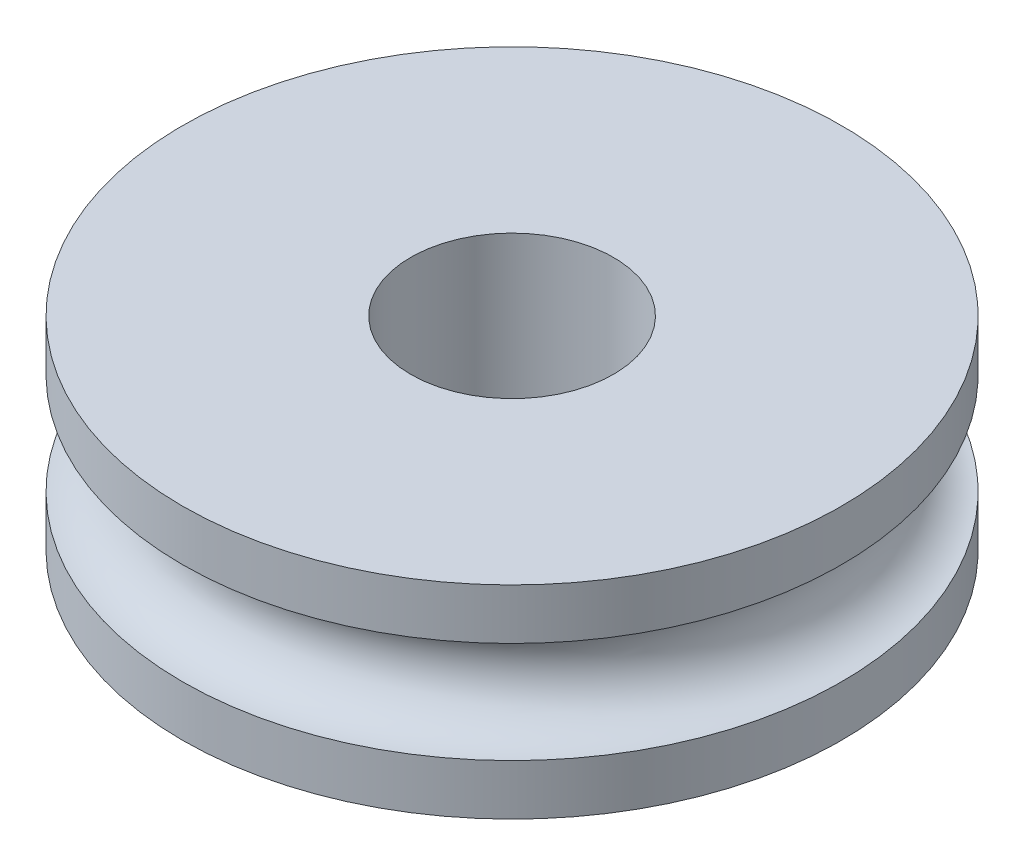
ISO-10303-21;
HEADER;
FILE_DESCRIPTION(('STEP AP214'),'2;1');
FILE_NAME('part.step','',(''),(''),'','','');
FILE_SCHEMA(('AUTOMOTIVE_DESIGN { 1 0 10303 214 1 1 1 1 }'));
ENDSEC;
DATA;
#1=APPLICATION_CONTEXT('core data for automotive mechanical design processes');
#2=APPLICATION_PROTOCOL_DEFINITION('international standard','automotive_design',2000,#1);
#3=PRODUCT_CONTEXT('',#1,'mechanical');
#4=PRODUCT('Part','Part','',(#3));
#5=PRODUCT_RELATED_PRODUCT_CATEGORY('part','',(#4));
#6=PRODUCT_DEFINITION_FORMATION('','',#4);
#7=PRODUCT_DEFINITION_CONTEXT('part definition',#1,'design');
#8=PRODUCT_DEFINITION('design','',#6,#7);
#9=PRODUCT_DEFINITION_SHAPE('','',#8);
#10=(LENGTH_UNIT() NAMED_UNIT(*) SI_UNIT(.MILLI.,.METRE.));
#11=(NAMED_UNIT(*) PLANE_ANGLE_UNIT() SI_UNIT($,.RADIAN.));
#12=(NAMED_UNIT(*) SI_UNIT($,.STERADIAN.) SOLID_ANGLE_UNIT());
#13=UNCERTAINTY_MEASURE_WITH_UNIT(LENGTH_MEASURE(1.E-05),#10,'distance_accuracy_value','');
#14=(GEOMETRIC_REPRESENTATION_CONTEXT(3) GLOBAL_UNCERTAINTY_ASSIGNED_CONTEXT((#13)) GLOBAL_UNIT_ASSIGNED_CONTEXT((#10,
#11,#12)) REPRESENTATION_CONTEXT('',''));
#15=CARTESIAN_POINT('',(0.,0.,0.));
#16=DIRECTION('',(0.,0.,1.));
#17=DIRECTION('',(1.,0.,0.));
#18=AXIS2_PLACEMENT_3D('',#15,#16,#17);
#19=CARTESIAN_POINT('',(74.5,50.02643198464,-44.43));
#20=DIRECTION('',(0.,1.,0.));
#21=DIRECTION('',(0.,0.,1.));
#22=AXIS2_PLACEMENT_3D('',#19,#20,#21);
#23=CYLINDRICAL_SURFACE('',#22,6.50000000000001);
#24=CARTESIAN_POINT('',(74.5,54.52643198464,-44.43));
#25=DIRECTION('',(0.,1.,0.));
#26=DIRECTION('',(0.,0.,1.));
#27=AXIS2_PLACEMENT_3D('',#24,#25,#26);
#28=CIRCLE('',#27,6.50000000000001);
#29=CARTESIAN_POINT('',(74.5,54.52643198464,-37.93));
#30=VERTEX_POINT('',#29);
#31=EDGE_CURVE('E27',#30,#30,#28,.F.);
#32=ORIENTED_EDGE('',*,*,#31,.T.);
#33=EDGE_LOOP('',(#32));
#34=FACE_BOUND('',#33,.T.);
#35=CARTESIAN_POINT('',(74.5,53.52643198464,-44.43));
#36=DIRECTION('',(0.,1.,0.));
#37=DIRECTION('',(0.,0.,1.));
#38=AXIS2_PLACEMENT_3D('',#35,#36,#37);
#39=CIRCLE('',#38,6.50000000000001);
#40=CARTESIAN_POINT('',(74.5,53.52643198464,-37.93));
#41=VERTEX_POINT('',#40);
#42=EDGE_CURVE('E39',#41,#41,#39,.T.);
#43=ORIENTED_EDGE('',*,*,#42,.T.);
#44=EDGE_LOOP('',(#43));
#45=FACE_BOUND('',#44,.T.);
#46=ADVANCED_FACE('F24',(#34,#45),#23,.T.);
#47=CARTESIAN_POINT('',(74.5,52.52643198464,-44.43));
#48=DIRECTION('',(0.,1.,0.));
#49=DIRECTION('',(1.,0.,0.));
#50=AXIS2_PLACEMENT_3D('',#47,#48,#49);
#51=TOROIDAL_SURFACE('',#50,6.50000000000001,1.);
#52=ORIENTED_EDGE('',*,*,#42,.F.);
#53=EDGE_LOOP('',(#52));
#54=FACE_BOUND('',#53,.T.);
#55=CARTESIAN_POINT('',(74.5,51.52643198464,-44.43));
#56=DIRECTION('',(0.,1.,0.));
#57=DIRECTION('',(0.,0.,1.));
#58=AXIS2_PLACEMENT_3D('',#55,#56,#57);
#59=CIRCLE('',#58,6.50000000000001);
#60=CARTESIAN_POINT('',(74.5,51.52643198464,-37.93));
#61=VERTEX_POINT('',#60);
#62=EDGE_CURVE('E42',#61,#61,#59,.F.);
#63=ORIENTED_EDGE('',*,*,#62,.F.);
#64=EDGE_LOOP('',(#63));
#65=FACE_BOUND('',#64,.T.);
#66=ADVANCED_FACE('F51',(#54,#65),#51,.F.);
#67=CARTESIAN_POINT('',(83.5,54.52643198464,-52.35926627001));
#68=DIRECTION('',(0.,-1.,0.));
#69=DIRECTION('',(0.,0.,-1.));
#70=AXIS2_PLACEMENT_3D('',#67,#68,#69);
#71=PLANE('',#70);
#72=CARTESIAN_POINT('',(74.5,54.52643198464,-44.43));
#73=DIRECTION('',(0.,1.,0.));
#74=DIRECTION('',(0.,0.,1.));
#75=AXIS2_PLACEMENT_3D('',#72,#73,#74);
#76=CIRCLE('',#75,2.);
#77=CARTESIAN_POINT('',(74.5,54.52643198464,-42.43));
#78=VERTEX_POINT('',#77);
#79=EDGE_CURVE('E36',#78,#78,#76,.F.);
#80=ORIENTED_EDGE('',*,*,#79,.T.);
#81=EDGE_LOOP('',(#80));
#82=FACE_BOUND('',#81,.T.);
#83=ORIENTED_EDGE('',*,*,#31,.F.);
#84=EDGE_LOOP('',(#83));
#85=FACE_BOUND('',#84,.T.);
#86=ADVANCED_FACE('F54',(#82,#85),#71,.F.);
#87=CARTESIAN_POINT('',(74.5,50.02643198464,-44.43));
#88=DIRECTION('',(0.,1.,0.));
#89=DIRECTION('',(0.,0.,1.));
#90=AXIS2_PLACEMENT_3D('',#87,#88,#89);
#91=CYLINDRICAL_SURFACE('',#90,6.50000000000001);
#92=CARTESIAN_POINT('',(74.5,50.52643198464,-44.43));
#93=DIRECTION('',(0.,1.,0.));
#94=DIRECTION('',(0.,0.,1.));
#95=AXIS2_PLACEMENT_3D('',#92,#93,#94);
#96=CIRCLE('',#95,6.50000000000001);
#97=CARTESIAN_POINT('',(74.5,50.52643198464,-37.93));
#98=VERTEX_POINT('',#97);
#99=EDGE_CURVE('E31',#98,#98,#96,.T.);
#100=ORIENTED_EDGE('',*,*,#99,.T.);
#101=EDGE_LOOP('',(#100));
#102=FACE_BOUND('',#101,.T.);
#103=ORIENTED_EDGE('',*,*,#62,.T.);
#104=EDGE_LOOP('',(#103));
#105=FACE_BOUND('',#104,.T.);
#106=ADVANCED_FACE('F58',(#102,#105),#91,.T.);
#107=CARTESIAN_POINT('',(74.5,50.02643198464,-44.43));
#108=DIRECTION('',(0.,1.,0.));
#109=DIRECTION('',(0.,0.,1.));
#110=AXIS2_PLACEMENT_3D('',#107,#108,#109);
#111=CYLINDRICAL_SURFACE('',#110,2.);
#112=CARTESIAN_POINT('',(74.5,50.52643198464,-44.43));
#113=DIRECTION('',(0.,1.,0.));
#114=DIRECTION('',(0.,0.,1.));
#115=AXIS2_PLACEMENT_3D('',#112,#113,#114);
#116=CIRCLE('',#115,2.);
#117=CARTESIAN_POINT('',(74.5,50.52643198464,-42.43));
#118=VERTEX_POINT('',#117);
#119=EDGE_CURVE('E12',#118,#118,#116,.F.);
#120=ORIENTED_EDGE('',*,*,#119,.T.);
#121=EDGE_LOOP('',(#120));
#122=FACE_BOUND('',#121,.T.);
#123=ORIENTED_EDGE('',*,*,#79,.F.);
#124=EDGE_LOOP('',(#123));
#125=FACE_BOUND('',#124,.T.);
#126=ADVANCED_FACE('F61',(#122,#125),#111,.F.);
#127=CARTESIAN_POINT('',(83.5,50.52643198464,-37.31836938706));
#128=DIRECTION('',(0.,1.,0.));
#129=DIRECTION('',(0.,0.,1.));
#130=AXIS2_PLACEMENT_3D('',#127,#128,#129);
#131=PLANE('',#130);
#132=ORIENTED_EDGE('',*,*,#119,.F.);
#133=EDGE_LOOP('',(#132));
#134=FACE_BOUND('',#133,.T.);
#135=ORIENTED_EDGE('',*,*,#99,.F.);
#136=EDGE_LOOP('',(#135));
#137=FACE_BOUND('',#136,.T.);
#138=ADVANCED_FACE('F65',(#134,#137),#131,.F.);
#139=CLOSED_SHELL('',(#46,#66,#86,#106,#126,#138));
#140=MANIFOLD_SOLID_BREP('B1',#139);
#141=ADVANCED_BREP_SHAPE_REPRESENTATION('',(#18,#140),#14);
#142=SHAPE_DEFINITION_REPRESENTATION(#9,#141);
ENDSEC;
END-ISO-10303-21;
